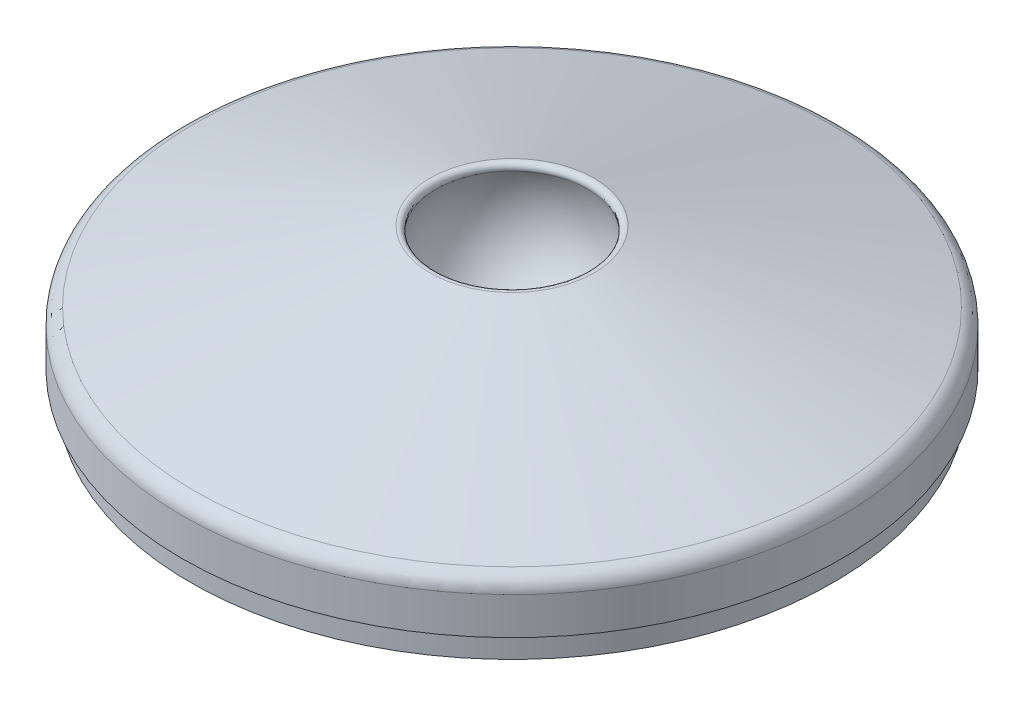
ISO-10303-21;
HEADER;
FILE_DESCRIPTION(('STEP AP214'),'2;1');
FILE_NAME('part.step','',(''),(''),'','','');
FILE_SCHEMA(('AUTOMOTIVE_DESIGN { 1 0 10303 214 1 1 1 1 }'));
ENDSEC;
DATA;
#1=APPLICATION_CONTEXT('core data for automotive mechanical design processes');
#2=APPLICATION_PROTOCOL_DEFINITION('international standard','automotive_design',2000,#1);
#3=PRODUCT_CONTEXT('',#1,'mechanical');
#4=PRODUCT('Part','Part','',(#3));
#5=PRODUCT_RELATED_PRODUCT_CATEGORY('part','',(#4));
#6=PRODUCT_DEFINITION_FORMATION('','',#4);
#7=PRODUCT_DEFINITION_CONTEXT('part definition',#1,'design');
#8=PRODUCT_DEFINITION('design','',#6,#7);
#9=PRODUCT_DEFINITION_SHAPE('','',#8);
#10=(LENGTH_UNIT() NAMED_UNIT(*) SI_UNIT(.MILLI.,.METRE.));
#11=(NAMED_UNIT(*) PLANE_ANGLE_UNIT() SI_UNIT($,.RADIAN.));
#12=(NAMED_UNIT(*) SI_UNIT($,.STERADIAN.) SOLID_ANGLE_UNIT());
#13=UNCERTAINTY_MEASURE_WITH_UNIT(LENGTH_MEASURE(1.E-05),#10,'distance_accuracy_value','');
#14=(GEOMETRIC_REPRESENTATION_CONTEXT(3) GLOBAL_UNCERTAINTY_ASSIGNED_CONTEXT((#13)) GLOBAL_UNIT_ASSIGNED_CONTEXT((#10,
#11,#12)) REPRESENTATION_CONTEXT('',''));
#15=CARTESIAN_POINT('',(0.,0.,0.));
#16=DIRECTION('',(0.,0.,1.));
#17=DIRECTION('',(1.,0.,0.));
#18=AXIS2_PLACEMENT_3D('',#15,#16,#17);
#19=CARTESIAN_POINT('',(0.,9.01477832512315,0.));
#20=DIRECTION('',(0.,-1.,0.));
#21=DIRECTION('',(0.,0.,-1.));
#22=AXIS2_PLACEMENT_3D('',#19,#20,#21);
#23=CONICAL_SURFACE('',#22,0.,1.27888765706536);
#24=CARTESIAN_POINT('',(0.,3.2189427530704,0.));
#25=DIRECTION('',(0.,1.,0.));
#26=DIRECTION('',(0.,0.,1.));
#27=AXIS2_PLACEMENT_3D('',#24,#25,#26);
#28=CIRCLE('',#27,19.2877806742083);
#29=CARTESIAN_POINT('',(0.,3.2189427530704,19.2877806742083));
#30=VERTEX_POINT('',#29);
#31=EDGE_CURVE('E39',#30,#30,#28,.T.);
#32=ORIENTED_EDGE('',*,*,#31,.T.);
#33=EDGE_LOOP('',(#32));
#34=FACE_BOUND('',#33,.T.);
#35=CARTESIAN_POINT('',(0.,7.517728682657,0.));
#36=DIRECTION('',(0.,-1.,0.));
#37=DIRECTION('',(0.,0.,-1.));
#38=AXIS2_PLACEMENT_3D('',#35,#36,#37);
#39=CIRCLE('',#38,4.98198487574801);
#40=CARTESIAN_POINT('',(0.,7.517728682657,-4.98198487574801));
#41=VERTEX_POINT('',#40);
#42=EDGE_CURVE('E47',#41,#41,#39,.T.);
#43=ORIENTED_EDGE('',*,*,#42,.T.);
#44=EDGE_LOOP('',(#43));
#45=FACE_BOUND('',#44,.T.);
#46=ADVANCED_FACE('F32',(#34,#45),#23,.T.);
#47=CARTESIAN_POINT('',(0.,35.0246305418719,0.));
#48=DIRECTION('',(0.,1.,0.));
#49=DIRECTION('',(0.,0.,1.));
#50=AXIS2_PLACEMENT_3D('',#47,#48,#49);
#51=CYLINDRICAL_SURFACE('',#50,20.);
#52=CARTESIAN_POINT('',(0.,2.2612464110328,0.));
#53=DIRECTION('',(0.,-1.,0.));
#54=DIRECTION('',(0.,0.,-1.));
#55=AXIS2_PLACEMENT_3D('',#52,#53,#54);
#56=CIRCLE('',#55,20.);
#57=CARTESIAN_POINT('',(0.,2.2612464110328,-20.));
#58=VERTEX_POINT('',#57);
#59=EDGE_CURVE('E10',#58,#58,#56,.T.);
#60=ORIENTED_EDGE('',*,*,#59,.T.);
#61=EDGE_LOOP('',(#60));
#62=FACE_BOUND('',#61,.T.);
#63=CARTESIAN_POINT('',(0.,0.,0.));
#64=DIRECTION('',(0.,1.,0.));
#65=DIRECTION('',(0.,0.,1.));
#66=AXIS2_PLACEMENT_3D('',#63,#64,#65);
#67=CIRCLE('',#66,20.);
#68=CARTESIAN_POINT('',(0.,0.,20.));
#69=VERTEX_POINT('',#68);
#70=EDGE_CURVE('E55',#69,#69,#67,.T.);
#71=ORIENTED_EDGE('',*,*,#70,.T.);
#72=EDGE_LOOP('',(#71));
#73=FACE_BOUND('',#72,.T.);
#74=ADVANCED_FACE('F75',(#62,#73),#51,.T.);
#75=CARTESIAN_POINT('',(0.,0.,0.));
#76=DIRECTION('',(0.,-1.,0.));
#77=DIRECTION('',(0.,0.,-1.));
#78=AXIS2_PLACEMENT_3D('',#75,#76,#77);
#79=PLANE('',#78);
#80=CARTESIAN_POINT('',(0.,0.,0.));
#81=DIRECTION('',(0.,-1.,0.));
#82=DIRECTION('',(0.,0.,-1.));
#83=AXIS2_PLACEMENT_3D('',#80,#81,#82);
#84=CIRCLE('',#83,19.5);
#85=CARTESIAN_POINT('',(0.,0.,-19.5));
#86=VERTEX_POINT('',#85);
#87=EDGE_CURVE('E43',#86,#86,#84,.T.);
#88=ORIENTED_EDGE('',*,*,#87,.F.);
#89=EDGE_LOOP('',(#88));
#90=FACE_BOUND('',#89,.T.);
#91=ORIENTED_EDGE('',*,*,#70,.F.);
#92=EDGE_LOOP('',(#91));
#93=FACE_BOUND('',#92,.T.);
#94=ADVANCED_FACE('F71',(#90,#93),#79,.T.);
#95=CARTESIAN_POINT('',(0.,5.2,0.));
#96=DIRECTION('',(0.,1.,0.));
#97=DIRECTION('',(1.,0.,0.));
#98=AXIS2_PLACEMENT_3D('',#95,#96,#97);
#99=SPHERICAL_SURFACE('',#98,5.);
#100=CARTESIAN_POINT('',(0.,7.1154903585337,0.));
#101=DIRECTION('',(0.,-1.,0.));
#102=DIRECTION('',(0.,0.,-1.));
#103=AXIS2_PLACEMENT_3D('',#100,#101,#102);
#104=CIRCLE('',#103,4.61853837121274);
#105=CARTESIAN_POINT('',(0.,7.1154903585337,-4.61853837121274));
#106=VERTEX_POINT('',#105);
#107=EDGE_CURVE('E52',#106,#106,#104,.F.);
#108=ORIENTED_EDGE('',*,*,#107,.T.);
#109=EDGE_LOOP('',(#108));
#110=FACE_BOUND('',#109,.T.);
#111=ADVANCED_FACE('F74',(#110),#99,.F.);
#112=CARTESIAN_POINT('',(0.,7.23041978004572,0.));
#113=DIRECTION('',(0.,1.,0.));
#114=DIRECTION('',(0.,0.,1.));
#115=AXIS2_PLACEMENT_3D('',#112,#113,#114);
#116=TOROIDAL_SURFACE('',#115,4.89565067348551,0.3);
#117=ORIENTED_EDGE('',*,*,#42,.F.);
#118=EDGE_LOOP('',(#117));
#119=FACE_BOUND('',#118,.T.);
#120=ORIENTED_EDGE('',*,*,#107,.F.);
#121=EDGE_LOOP('',(#120));
#122=FACE_BOUND('',#121,.T.);
#123=ADVANCED_FACE('F67',(#119,#122),#116,.T.);
#124=CARTESIAN_POINT('',(0.,-1.5,0.));
#125=DIRECTION('',(0.,1.,0.));
#126=DIRECTION('',(0.,0.,1.));
#127=AXIS2_PLACEMENT_3D('',#124,#125,#126);
#128=CYLINDRICAL_SURFACE('',#127,19.5);
#129=CARTESIAN_POINT('',(0.,-1.5,0.));
#130=DIRECTION('',(0.,-1.,0.));
#131=DIRECTION('',(0.,0.,-1.));
#132=AXIS2_PLACEMENT_3D('',#129,#130,#131);
#133=CIRCLE('',#132,19.5);
#134=CARTESIAN_POINT('',(0.,-1.5,-19.5));
#135=VERTEX_POINT('',#134);
#136=EDGE_CURVE('E57',#135,#135,#133,.T.);
#137=ORIENTED_EDGE('',*,*,#136,.F.);
#138=EDGE_LOOP('',(#137));
#139=FACE_BOUND('',#138,.T.);
#140=ORIENTED_EDGE('',*,*,#87,.T.);
#141=EDGE_LOOP('',(#140));
#142=FACE_BOUND('',#141,.T.);
#143=ADVANCED_FACE('F64',(#139,#142),#128,.T.);
#144=CARTESIAN_POINT('',(0.,-1.5,0.));
#145=DIRECTION('',(0.,-1.,0.));
#146=DIRECTION('',(0.,0.,-1.));
#147=AXIS2_PLACEMENT_3D('',#144,#145,#146);
#148=PLANE('',#147);
#149=ORIENTED_EDGE('',*,*,#136,.T.);
#150=EDGE_LOOP('',(#149));
#151=FACE_BOUND('',#150,.T.);
#152=ADVANCED_FACE('F62',(#151),#148,.T.);
#153=CARTESIAN_POINT('',(0.,2.2612464110328,0.));
#154=DIRECTION('',(0.,-1.,0.));
#155=DIRECTION('',(0.,0.,-1.));
#156=AXIS2_PLACEMENT_3D('',#153,#154,#155);
#157=TOROIDAL_SURFACE('',#156,19.,1.);
#158=ORIENTED_EDGE('',*,*,#59,.F.);
#159=EDGE_LOOP('',(#158));
#160=FACE_BOUND('',#159,.T.);
#161=ORIENTED_EDGE('',*,*,#31,.F.);
#162=EDGE_LOOP('',(#161));
#163=FACE_BOUND('',#162,.T.);
#164=ADVANCED_FACE('F34',(#160,#163),#157,.T.);
#165=CLOSED_SHELL('',(#46,#74,#94,#111,#123,#143,#152,#164));
#166=MANIFOLD_SOLID_BREP('B2',#165);
#167=ADVANCED_BREP_SHAPE_REPRESENTATION('',(#18,#166),#14);
#168=SHAPE_DEFINITION_REPRESENTATION(#9,#167);
ENDSEC;
END-ISO-10303-21;
